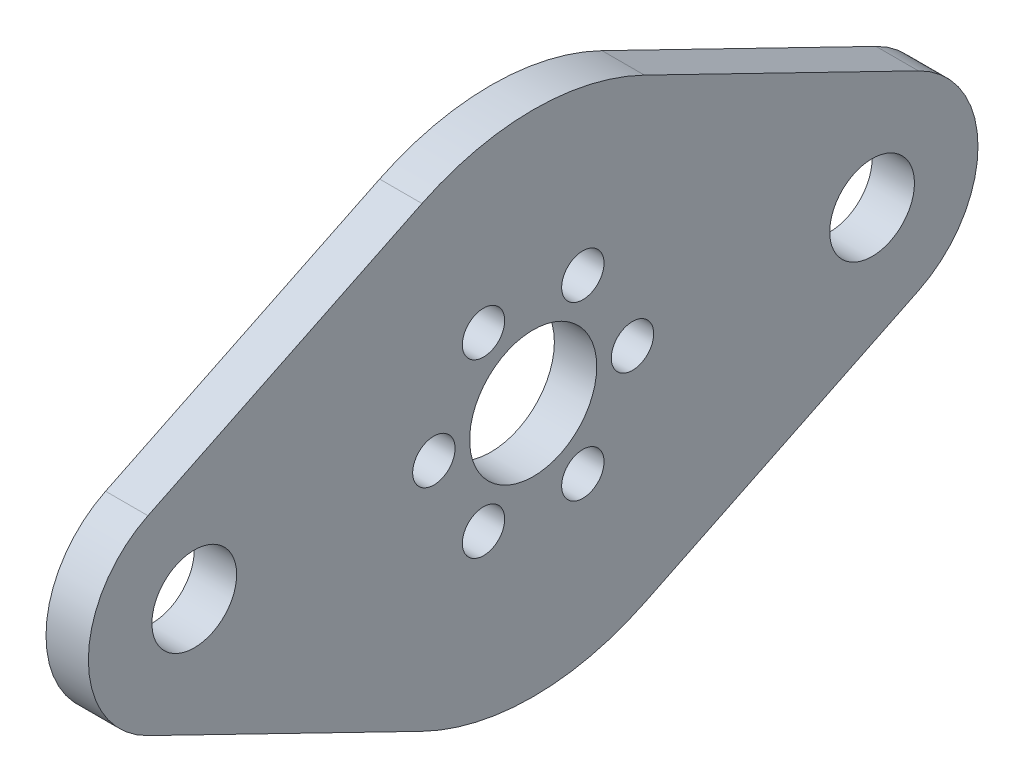
ISO-10303-21;
HEADER;
FILE_DESCRIPTION(('STEP AP214'),'2;1');
FILE_NAME('part.step','',(''),(''),'','','');
FILE_SCHEMA(('AUTOMOTIVE_DESIGN { 1 0 10303 214 1 1 1 1 }'));
ENDSEC;
DATA;
#1=APPLICATION_CONTEXT('core data for automotive mechanical design processes');
#2=APPLICATION_PROTOCOL_DEFINITION('international standard','automotive_design',2000,#1);
#3=PRODUCT_CONTEXT('',#1,'mechanical');
#4=PRODUCT('Part','Part','',(#3));
#5=PRODUCT_RELATED_PRODUCT_CATEGORY('part','',(#4));
#6=PRODUCT_DEFINITION_FORMATION('','',#4);
#7=PRODUCT_DEFINITION_CONTEXT('part definition',#1,'design');
#8=PRODUCT_DEFINITION('design','',#6,#7);
#9=PRODUCT_DEFINITION_SHAPE('','',#8);
#10=(LENGTH_UNIT() NAMED_UNIT(*) SI_UNIT(.MILLI.,.METRE.));
#11=(NAMED_UNIT(*) PLANE_ANGLE_UNIT() SI_UNIT($,.RADIAN.));
#12=(NAMED_UNIT(*) SI_UNIT($,.STERADIAN.) SOLID_ANGLE_UNIT());
#13=UNCERTAINTY_MEASURE_WITH_UNIT(LENGTH_MEASURE(1.E-05),#10,'distance_accuracy_value','');
#14=(GEOMETRIC_REPRESENTATION_CONTEXT(3) GLOBAL_UNCERTAINTY_ASSIGNED_CONTEXT((#13)) GLOBAL_UNIT_ASSIGNED_CONTEXT((#10,
#11,#12)) REPRESENTATION_CONTEXT('',''));
#15=CARTESIAN_POINT('',(0.,0.,0.));
#16=DIRECTION('',(0.,0.,1.));
#17=DIRECTION('',(1.,0.,0.));
#18=AXIS2_PLACEMENT_3D('',#15,#16,#17);
#19=CARTESIAN_POINT('',(3.175,0.,25.4));
#20=DIRECTION('',(1.,0.,0.));
#21=DIRECTION('',(0.,0.,-1.));
#22=AXIS2_PLACEMENT_3D('',#19,#20,#21);
#23=PLANE('',#22);
#24=CARTESIAN_POINT('',(3.175,0.,-7.4422));
#25=DIRECTION('',(1.,0.,0.));
#26=DIRECTION('',(0.,0.,-1.));
#27=AXIS2_PLACEMENT_3D('',#24,#25,#26);
#28=CIRCLE('',#27,1.5875);
#29=CARTESIAN_POINT('',(3.175,0.,-9.0297));
#30=VERTEX_POINT('',#29);
#31=EDGE_CURVE('E217',#30,#30,#28,.T.);
#32=ORIENTED_EDGE('',*,*,#31,.F.);
#33=EDGE_LOOP('',(#32));
#34=FACE_BOUND('',#33,.T.);
#35=CARTESIAN_POINT('',(3.175,6.44513426004454,3.72110000000002));
#36=DIRECTION('',(1.,0.,0.));
#37=DIRECTION('',(0.,0.,-1.));
#38=AXIS2_PLACEMENT_3D('',#35,#36,#37);
#39=CIRCLE('',#38,1.5875);
#40=CARTESIAN_POINT('',(3.175,6.44513426004454,2.13360000000002));
#41=VERTEX_POINT('',#40);
#42=EDGE_CURVE('E205',#41,#41,#39,.T.);
#43=ORIENTED_EDGE('',*,*,#42,.F.);
#44=EDGE_LOOP('',(#43));
#45=FACE_BOUND('',#44,.T.);
#46=CARTESIAN_POINT('',(3.175,-6.44513426004456,3.72109999999998));
#47=DIRECTION('',(1.,0.,0.));
#48=DIRECTION('',(0.,0.,-1.));
#49=AXIS2_PLACEMENT_3D('',#46,#47,#48);
#50=CIRCLE('',#49,1.5875);
#51=CARTESIAN_POINT('',(3.175,-6.44513426004456,2.13359999999998));
#52=VERTEX_POINT('',#51);
#53=EDGE_CURVE('E193',#52,#52,#50,.T.);
#54=ORIENTED_EDGE('',*,*,#53,.F.);
#55=EDGE_LOOP('',(#54));
#56=FACE_BOUND('',#55,.T.);
#57=CARTESIAN_POINT('',(3.175,0.,25.4));
#58=DIRECTION('',(1.,0.,0.));
#59=DIRECTION('',(0.,0.,-1.));
#60=AXIS2_PLACEMENT_3D('',#57,#58,#59);
#61=CIRCLE('',#60,3.175);
#62=CARTESIAN_POINT('',(3.175,0.,22.225));
#63=VERTEX_POINT('',#62);
#64=EDGE_CURVE('E181',#63,#63,#61,.T.);
#65=ORIENTED_EDGE('',*,*,#64,.F.);
#66=EDGE_LOOP('',(#65));
#67=FACE_BOUND('',#66,.T.);
#68=CARTESIAN_POINT('',(3.175,0.,25.4));
#69=DIRECTION('',(1.,0.,0.));
#70=DIRECTION('',(0.,0.,-1.));
#71=AXIS2_PLACEMENT_3D('',#68,#69,#70);
#72=CIRCLE('',#71,7.9375);
#73=CARTESIAN_POINT('',(3.175,7.13754613430525,28.87265625));
#74=VERTEX_POINT('',#73);
#75=CARTESIAN_POINT('',(3.175,-7.13754613430526,28.87265625));
#76=VERTEX_POINT('',#75);
#77=EDGE_CURVE('E144',#74,#76,#72,.T.);
#78=ORIENTED_EDGE('',*,*,#77,.T.);
#79=DIRECTION('',(0.,-0.4375,-0.899218410621135));
#80=VECTOR('',#79,1.);
#81=CARTESIAN_POINT('',(3.175,-17.1301107223326,8.334375));
#82=LINE('',#81,#80);
#83=CARTESIAN_POINT('',(3.175,-17.1301107223326,8.33437499999999));
#84=VERTEX_POINT('',#83);
#85=EDGE_CURVE('E92',#76,#84,#82,.T.);
#86=ORIENTED_EDGE('',*,*,#85,.T.);
#87=CARTESIAN_POINT('',(3.175,0.,0.));
#88=DIRECTION('',(1.,0.,0.));
#89=DIRECTION('',(0.,0.,1.));
#90=AXIS2_PLACEMENT_3D('',#87,#88,#89);
#91=CIRCLE('',#90,19.05);
#92=CARTESIAN_POINT('',(3.175,-17.1301107223326,-8.334375));
#93=VERTEX_POINT('',#92);
#94=EDGE_CURVE('E159',#84,#93,#91,.T.);
#95=ORIENTED_EDGE('',*,*,#94,.T.);
#96=DIRECTION('',(0.,0.437500000000001,-0.899218410621135));
#97=VECTOR('',#96,1.);
#98=CARTESIAN_POINT('',(3.175,-7.13754613430525,-28.87265625));
#99=LINE('',#98,#97);
#100=CARTESIAN_POINT('',(3.175,-7.13754613430525,-28.87265625));
#101=VERTEX_POINT('',#100);
#102=EDGE_CURVE('E172',#93,#101,#99,.T.);
#103=ORIENTED_EDGE('',*,*,#102,.T.);
#104=CARTESIAN_POINT('',(3.175,0.,-25.4));
#105=DIRECTION('',(1.,0.,0.));
#106=DIRECTION('',(0.,0.,1.));
#107=AXIS2_PLACEMENT_3D('',#104,#105,#106);
#108=CIRCLE('',#107,7.9375);
#109=CARTESIAN_POINT('',(3.175,7.13754613430527,-28.87265625));
#110=VERTEX_POINT('',#109);
#111=EDGE_CURVE('E111',#101,#110,#108,.T.);
#112=ORIENTED_EDGE('',*,*,#111,.T.);
#113=DIRECTION('',(0.,0.437500000000001,0.899218410621134));
#114=VECTOR('',#113,1.);
#115=CARTESIAN_POINT('',(3.175,17.1301107223326,-8.33437500000003));
#116=LINE('',#115,#114);
#117=CARTESIAN_POINT('',(3.175,17.1301107223326,-8.33437500000002));
#118=VERTEX_POINT('',#117);
#119=EDGE_CURVE('E105',#110,#118,#116,.T.);
#120=ORIENTED_EDGE('',*,*,#119,.T.);
#121=CARTESIAN_POINT('',(3.175,0.,0.));
#122=DIRECTION('',(1.,0.,0.));
#123=DIRECTION('',(0.,0.,1.));
#124=AXIS2_PLACEMENT_3D('',#121,#122,#123);
#125=CIRCLE('',#124,19.05);
#126=CARTESIAN_POINT('',(3.175,17.1301107223326,8.334375));
#127=VERTEX_POINT('',#126);
#128=EDGE_CURVE('E109',#118,#127,#125,.T.);
#129=ORIENTED_EDGE('',*,*,#128,.T.);
#130=DIRECTION('',(0.,-0.4375,0.899218410621135));
#131=VECTOR('',#130,1.);
#132=CARTESIAN_POINT('',(3.175,7.13754613430525,28.87265625));
#133=LINE('',#132,#131);
#134=EDGE_CURVE('E49',#127,#74,#133,.T.);
#135=ORIENTED_EDGE('',*,*,#134,.T.);
#136=EDGE_LOOP('',(#78,#86,#95,#103,#112,#120,#129,#135));
#137=FACE_BOUND('',#136,.T.);
#138=CARTESIAN_POINT('',(3.175,0.,0.));
#139=DIRECTION('',(1.,0.,0.));
#140=DIRECTION('',(0.,0.,-1.));
#141=AXIS2_PLACEMENT_3D('',#138,#139,#140);
#142=CIRCLE('',#141,4.7625);
#143=CARTESIAN_POINT('',(3.175,0.,-4.7625));
#144=VERTEX_POINT('',#143);
#145=EDGE_CURVE('E133',#144,#144,#142,.T.);
#146=ORIENTED_EDGE('',*,*,#145,.F.);
#147=EDGE_LOOP('',(#146));
#148=FACE_BOUND('',#147,.T.);
#149=CARTESIAN_POINT('',(3.175,0.,-25.4));
#150=DIRECTION('',(1.,0.,0.));
#151=DIRECTION('',(0.,0.,-1.));
#152=AXIS2_PLACEMENT_3D('',#149,#150,#151);
#153=CIRCLE('',#152,3.175);
#154=CARTESIAN_POINT('',(3.175,0.,-28.575));
#155=VERTEX_POINT('',#154);
#156=EDGE_CURVE('E187',#155,#155,#153,.T.);
#157=ORIENTED_EDGE('',*,*,#156,.F.);
#158=EDGE_LOOP('',(#157));
#159=FACE_BOUND('',#158,.T.);
#160=CARTESIAN_POINT('',(3.175,6.44513426004456,-3.72109999999998));
#161=DIRECTION('',(1.,0.,0.));
#162=DIRECTION('',(0.,0.,-1.));
#163=AXIS2_PLACEMENT_3D('',#160,#161,#162);
#164=CIRCLE('',#163,1.5875);
#165=CARTESIAN_POINT('',(3.175,6.44513426004456,-5.30859999999998));
#166=VERTEX_POINT('',#165);
#167=EDGE_CURVE('E199',#166,#166,#164,.T.);
#168=ORIENTED_EDGE('',*,*,#167,.F.);
#169=EDGE_LOOP('',(#168));
#170=FACE_BOUND('',#169,.T.);
#171=CARTESIAN_POINT('',(3.175,-6.44513426004454,-3.72110000000002));
#172=DIRECTION('',(1.,0.,0.));
#173=DIRECTION('',(0.,0.,-1.));
#174=AXIS2_PLACEMENT_3D('',#171,#172,#173);
#175=CIRCLE('',#174,1.5875);
#176=CARTESIAN_POINT('',(3.175,-6.44513426004454,-5.30860000000002));
#177=VERTEX_POINT('',#176);
#178=EDGE_CURVE('E211',#177,#177,#175,.T.);
#179=ORIENTED_EDGE('',*,*,#178,.F.);
#180=EDGE_LOOP('',(#179));
#181=FACE_BOUND('',#180,.T.);
#182=CARTESIAN_POINT('',(3.175,0.,7.4422));
#183=DIRECTION('',(1.,0.,0.));
#184=DIRECTION('',(0.,0.,-1.));
#185=AXIS2_PLACEMENT_3D('',#182,#183,#184);
#186=CIRCLE('',#185,1.5875);
#187=CARTESIAN_POINT('',(3.175,0.,5.8547));
#188=VERTEX_POINT('',#187);
#189=EDGE_CURVE('E223',#188,#188,#186,.T.);
#190=ORIENTED_EDGE('',*,*,#189,.F.);
#191=EDGE_LOOP('',(#190));
#192=FACE_BOUND('',#191,.T.);
#193=ADVANCED_FACE('F32',(#34,#45,#56,#67,#137,#148,#159,#170,#181,#192),#23,.T.);
#194=CARTESIAN_POINT('',(0.,0.,25.4));
#195=DIRECTION('',(1.,0.,0.));
#196=DIRECTION('',(0.,0.,-1.));
#197=AXIS2_PLACEMENT_3D('',#194,#195,#196);
#198=PLANE('',#197);
#199=CARTESIAN_POINT('',(0.,0.,25.4));
#200=DIRECTION('',(1.,0.,0.));
#201=DIRECTION('',(0.,0.,-1.));
#202=AXIS2_PLACEMENT_3D('',#199,#200,#201);
#203=CIRCLE('',#202,7.9375);
#204=CARTESIAN_POINT('',(0.,7.13754613430525,28.87265625));
#205=VERTEX_POINT('',#204);
#206=CARTESIAN_POINT('',(0.,-7.13754613430526,28.87265625));
#207=VERTEX_POINT('',#206);
#208=EDGE_CURVE('E129',#205,#207,#203,.T.);
#209=ORIENTED_EDGE('',*,*,#208,.F.);
#210=DIRECTION('',(0.,-0.4375,0.899218410621135));
#211=VECTOR('',#210,1.);
#212=CARTESIAN_POINT('',(0.,7.13754613430525,28.87265625));
#213=LINE('',#212,#211);
#214=CARTESIAN_POINT('',(0.,17.1301107223326,8.334375));
#215=VERTEX_POINT('',#214);
#216=EDGE_CURVE('E84',#215,#205,#213,.T.);
#217=ORIENTED_EDGE('',*,*,#216,.F.);
#218=CARTESIAN_POINT('',(0.,0.,0.));
#219=DIRECTION('',(1.,0.,0.));
#220=DIRECTION('',(0.,0.,1.));
#221=AXIS2_PLACEMENT_3D('',#218,#219,#220);
#222=CIRCLE('',#221,19.05);
#223=CARTESIAN_POINT('',(0.,17.1301107223326,-8.33437500000002));
#224=VERTEX_POINT('',#223);
#225=EDGE_CURVE('E78',#224,#215,#222,.T.);
#226=ORIENTED_EDGE('',*,*,#225,.F.);
#227=DIRECTION('',(0.,0.437500000000001,0.899218410621134));
#228=VECTOR('',#227,1.);
#229=CARTESIAN_POINT('',(0.,17.1301107223326,-8.33437500000003));
#230=LINE('',#229,#228);
#231=CARTESIAN_POINT('',(0.,7.13754613430527,-28.87265625));
#232=VERTEX_POINT('',#231);
#233=EDGE_CURVE('E119',#232,#224,#230,.T.);
#234=ORIENTED_EDGE('',*,*,#233,.F.);
#235=CARTESIAN_POINT('',(0.,0.,-25.4));
#236=DIRECTION('',(1.,0.,0.));
#237=DIRECTION('',(0.,0.,1.));
#238=AXIS2_PLACEMENT_3D('',#235,#236,#237);
#239=CIRCLE('',#238,7.9375);
#240=CARTESIAN_POINT('',(0.,-7.13754613430525,-28.87265625));
#241=VERTEX_POINT('',#240);
#242=EDGE_CURVE('E139',#241,#232,#239,.T.);
#243=ORIENTED_EDGE('',*,*,#242,.F.);
#244=DIRECTION('',(0.,0.437500000000001,-0.899218410621135));
#245=VECTOR('',#244,1.);
#246=CARTESIAN_POINT('',(0.,-7.13754613430525,-28.87265625));
#247=LINE('',#246,#245);
#248=CARTESIAN_POINT('',(0.,-17.1301107223326,-8.334375));
#249=VERTEX_POINT('',#248);
#250=EDGE_CURVE('E137',#249,#241,#247,.T.);
#251=ORIENTED_EDGE('',*,*,#250,.F.);
#252=CARTESIAN_POINT('',(0.,0.,0.));
#253=DIRECTION('',(1.,0.,0.));
#254=DIRECTION('',(0.,0.,1.));
#255=AXIS2_PLACEMENT_3D('',#252,#253,#254);
#256=CIRCLE('',#255,19.05);
#257=CARTESIAN_POINT('',(0.,-17.1301107223326,8.33437499999999));
#258=VERTEX_POINT('',#257);
#259=EDGE_CURVE('E135',#258,#249,#256,.T.);
#260=ORIENTED_EDGE('',*,*,#259,.F.);
#261=DIRECTION('',(0.,-0.4375,-0.899218410621135));
#262=VECTOR('',#261,1.);
#263=CARTESIAN_POINT('',(0.,-17.1301107223326,8.334375));
#264=LINE('',#263,#262);
#265=EDGE_CURVE('E132',#207,#258,#264,.T.);
#266=ORIENTED_EDGE('',*,*,#265,.F.);
#267=EDGE_LOOP('',(#209,#217,#226,#234,#243,#251,#260,#266));
#268=FACE_BOUND('',#267,.T.);
#269=CARTESIAN_POINT('',(0.,0.,0.));
#270=DIRECTION('',(1.,0.,0.));
#271=DIRECTION('',(0.,0.,-1.));
#272=AXIS2_PLACEMENT_3D('',#269,#270,#271);
#273=CIRCLE('',#272,4.7625);
#274=CARTESIAN_POINT('',(0.,0.,-4.7625));
#275=VERTEX_POINT('',#274);
#276=EDGE_CURVE('E178',#275,#275,#273,.T.);
#277=ORIENTED_EDGE('',*,*,#276,.T.);
#278=EDGE_LOOP('',(#277));
#279=FACE_BOUND('',#278,.T.);
#280=CARTESIAN_POINT('',(0.,0.,25.4));
#281=DIRECTION('',(1.,0.,0.));
#282=DIRECTION('',(0.,0.,-1.));
#283=AXIS2_PLACEMENT_3D('',#280,#281,#282);
#284=CIRCLE('',#283,3.175);
#285=CARTESIAN_POINT('',(0.,0.,22.225));
#286=VERTEX_POINT('',#285);
#287=EDGE_CURVE('E184',#286,#286,#284,.T.);
#288=ORIENTED_EDGE('',*,*,#287,.T.);
#289=EDGE_LOOP('',(#288));
#290=FACE_BOUND('',#289,.T.);
#291=CARTESIAN_POINT('',(0.,0.,-25.4));
#292=DIRECTION('',(1.,0.,0.));
#293=DIRECTION('',(0.,0.,-1.));
#294=AXIS2_PLACEMENT_3D('',#291,#292,#293);
#295=CIRCLE('',#294,3.175);
#296=CARTESIAN_POINT('',(0.,0.,-28.575));
#297=VERTEX_POINT('',#296);
#298=EDGE_CURVE('E190',#297,#297,#295,.T.);
#299=ORIENTED_EDGE('',*,*,#298,.T.);
#300=EDGE_LOOP('',(#299));
#301=FACE_BOUND('',#300,.T.);
#302=CARTESIAN_POINT('',(0.,-6.44513426004456,3.72109999999998));
#303=DIRECTION('',(1.,0.,0.));
#304=DIRECTION('',(0.,0.,-1.));
#305=AXIS2_PLACEMENT_3D('',#302,#303,#304);
#306=CIRCLE('',#305,1.5875);
#307=CARTESIAN_POINT('',(0.,-6.44513426004456,2.13359999999998));
#308=VERTEX_POINT('',#307);
#309=EDGE_CURVE('E196',#308,#308,#306,.T.);
#310=ORIENTED_EDGE('',*,*,#309,.T.);
#311=EDGE_LOOP('',(#310));
#312=FACE_BOUND('',#311,.T.);
#313=CARTESIAN_POINT('',(0.,6.44513426004456,-3.72109999999998));
#314=DIRECTION('',(1.,0.,0.));
#315=DIRECTION('',(0.,0.,-1.));
#316=AXIS2_PLACEMENT_3D('',#313,#314,#315);
#317=CIRCLE('',#316,1.5875);
#318=CARTESIAN_POINT('',(0.,6.44513426004456,-5.30859999999998));
#319=VERTEX_POINT('',#318);
#320=EDGE_CURVE('E202',#319,#319,#317,.T.);
#321=ORIENTED_EDGE('',*,*,#320,.T.);
#322=EDGE_LOOP('',(#321));
#323=FACE_BOUND('',#322,.T.);
#324=CARTESIAN_POINT('',(0.,6.44513426004454,3.72110000000002));
#325=DIRECTION('',(1.,0.,0.));
#326=DIRECTION('',(0.,0.,-1.));
#327=AXIS2_PLACEMENT_3D('',#324,#325,#326);
#328=CIRCLE('',#327,1.5875);
#329=CARTESIAN_POINT('',(0.,6.44513426004454,2.13360000000002));
#330=VERTEX_POINT('',#329);
#331=EDGE_CURVE('E208',#330,#330,#328,.T.);
#332=ORIENTED_EDGE('',*,*,#331,.T.);
#333=EDGE_LOOP('',(#332));
#334=FACE_BOUND('',#333,.T.);
#335=CARTESIAN_POINT('',(0.,-6.44513426004454,-3.72110000000002));
#336=DIRECTION('',(1.,0.,0.));
#337=DIRECTION('',(0.,0.,-1.));
#338=AXIS2_PLACEMENT_3D('',#335,#336,#337);
#339=CIRCLE('',#338,1.5875);
#340=CARTESIAN_POINT('',(0.,-6.44513426004454,-5.30860000000002));
#341=VERTEX_POINT('',#340);
#342=EDGE_CURVE('E214',#341,#341,#339,.T.);
#343=ORIENTED_EDGE('',*,*,#342,.T.);
#344=EDGE_LOOP('',(#343));
#345=FACE_BOUND('',#344,.T.);
#346=CARTESIAN_POINT('',(0.,0.,-7.4422));
#347=DIRECTION('',(1.,0.,0.));
#348=DIRECTION('',(0.,0.,-1.));
#349=AXIS2_PLACEMENT_3D('',#346,#347,#348);
#350=CIRCLE('',#349,1.5875);
#351=CARTESIAN_POINT('',(0.,0.,-9.0297));
#352=VERTEX_POINT('',#351);
#353=EDGE_CURVE('E220',#352,#352,#350,.T.);
#354=ORIENTED_EDGE('',*,*,#353,.T.);
#355=EDGE_LOOP('',(#354));
#356=FACE_BOUND('',#355,.T.);
#357=CARTESIAN_POINT('',(0.,0.,7.4422));
#358=DIRECTION('',(1.,0.,0.));
#359=DIRECTION('',(0.,0.,-1.));
#360=AXIS2_PLACEMENT_3D('',#357,#358,#359);
#361=CIRCLE('',#360,1.5875);
#362=CARTESIAN_POINT('',(0.,0.,5.8547));
#363=VERTEX_POINT('',#362);
#364=EDGE_CURVE('E226',#363,#363,#361,.T.);
#365=ORIENTED_EDGE('',*,*,#364,.T.);
#366=EDGE_LOOP('',(#365));
#367=FACE_BOUND('',#366,.T.);
#368=ADVANCED_FACE('F163',(#268,#279,#290,#301,#312,#323,#334,#345,#356,#367),#198,.F.);
#369=CARTESIAN_POINT('',(3.175,0.,25.4));
#370=DIRECTION('',(-1.,0.,0.));
#371=DIRECTION('',(0.,0.,1.));
#372=AXIS2_PLACEMENT_3D('',#369,#370,#371);
#373=CYLINDRICAL_SURFACE('',#372,7.9375);
#374=ORIENTED_EDGE('',*,*,#208,.T.);
#375=DIRECTION('',(-1.,0.,0.));
#376=VECTOR('',#375,1.);
#377=CARTESIAN_POINT('',(3.175,-7.13754613430526,28.87265625));
#378=LINE('',#377,#376);
#379=EDGE_CURVE('E11',#76,#207,#378,.T.);
#380=ORIENTED_EDGE('',*,*,#379,.F.);
#381=ORIENTED_EDGE('',*,*,#77,.F.);
#382=DIRECTION('',(-1.,0.,0.));
#383=VECTOR('',#382,1.);
#384=CARTESIAN_POINT('',(3.175,7.13754613430525,28.87265625));
#385=LINE('',#384,#383);
#386=EDGE_CURVE('E125',#74,#205,#385,.T.);
#387=ORIENTED_EDGE('',*,*,#386,.T.);
#388=EDGE_LOOP('',(#374,#380,#381,#387));
#389=FACE_BOUND('',#388,.T.);
#390=ADVANCED_FACE('F34',(#389),#373,.T.);
#391=CARTESIAN_POINT('',(3.175,-17.1301107223326,8.334375));
#392=DIRECTION('',(0.,0.899218410621135,-0.4375));
#393=DIRECTION('',(0.,0.4375,0.899218410621135));
#394=AXIS2_PLACEMENT_3D('',#391,#392,#393);
#395=PLANE('',#394);
#396=ORIENTED_EDGE('',*,*,#265,.T.);
#397=DIRECTION('',(-1.,0.,0.));
#398=VECTOR('',#397,1.);
#399=CARTESIAN_POINT('',(3.175,-17.1301107223326,8.33437499999999));
#400=LINE('',#399,#398);
#401=EDGE_CURVE('E41',#84,#258,#400,.T.);
#402=ORIENTED_EDGE('',*,*,#401,.F.);
#403=ORIENTED_EDGE('',*,*,#85,.F.);
#404=ORIENTED_EDGE('',*,*,#379,.T.);
#405=EDGE_LOOP('',(#396,#402,#403,#404));
#406=FACE_BOUND('',#405,.T.);
#407=ADVANCED_FACE('F260',(#406),#395,.F.);
#408=CARTESIAN_POINT('',(3.175,0.,0.));
#409=DIRECTION('',(-1.,0.,0.));
#410=DIRECTION('',(0.,0.,1.));
#411=AXIS2_PLACEMENT_3D('',#408,#409,#410);
#412=CYLINDRICAL_SURFACE('',#411,19.05);
#413=ORIENTED_EDGE('',*,*,#259,.T.);
#414=DIRECTION('',(-1.,0.,0.));
#415=VECTOR('',#414,1.);
#416=CARTESIAN_POINT('',(3.175,-17.1301107223326,-8.334375));
#417=LINE('',#416,#415);
#418=EDGE_CURVE('E151',#93,#249,#417,.T.);
#419=ORIENTED_EDGE('',*,*,#418,.F.);
#420=ORIENTED_EDGE('',*,*,#94,.F.);
#421=ORIENTED_EDGE('',*,*,#401,.T.);
#422=EDGE_LOOP('',(#413,#419,#420,#421));
#423=FACE_BOUND('',#422,.T.);
#424=ADVANCED_FACE('F157',(#423),#412,.T.);
#425=CARTESIAN_POINT('',(3.175,-7.13754613430525,-28.87265625));
#426=DIRECTION('',(0.,0.899218410621135,0.4375));
#427=DIRECTION('',(0.,-0.437500000000001,0.899218410621135));
#428=AXIS2_PLACEMENT_3D('',#425,#426,#427);
#429=PLANE('',#428);
#430=ORIENTED_EDGE('',*,*,#250,.T.);
#431=DIRECTION('',(-1.,0.,0.));
#432=VECTOR('',#431,1.);
#433=CARTESIAN_POINT('',(3.175,-7.13754613430525,-28.87265625));
#434=LINE('',#433,#432);
#435=EDGE_CURVE('E148',#101,#241,#434,.T.);
#436=ORIENTED_EDGE('',*,*,#435,.F.);
#437=ORIENTED_EDGE('',*,*,#102,.F.);
#438=ORIENTED_EDGE('',*,*,#418,.T.);
#439=EDGE_LOOP('',(#430,#436,#437,#438));
#440=FACE_BOUND('',#439,.T.);
#441=ADVANCED_FACE('F168',(#440),#429,.F.);
#442=CARTESIAN_POINT('',(3.175,0.,-25.4));
#443=DIRECTION('',(-1.,0.,0.));
#444=DIRECTION('',(0.,0.,1.));
#445=AXIS2_PLACEMENT_3D('',#442,#443,#444);
#446=CYLINDRICAL_SURFACE('',#445,7.9375);
#447=ORIENTED_EDGE('',*,*,#242,.T.);
#448=DIRECTION('',(-1.,0.,0.));
#449=VECTOR('',#448,1.);
#450=CARTESIAN_POINT('',(3.175,7.13754613430527,-28.87265625));
#451=LINE('',#450,#449);
#452=EDGE_CURVE('E120',#110,#232,#451,.T.);
#453=ORIENTED_EDGE('',*,*,#452,.F.);
#454=ORIENTED_EDGE('',*,*,#111,.F.);
#455=ORIENTED_EDGE('',*,*,#435,.T.);
#456=EDGE_LOOP('',(#447,#453,#454,#455));
#457=FACE_BOUND('',#456,.T.);
#458=ADVANCED_FACE('F171',(#457),#446,.T.);
#459=CARTESIAN_POINT('',(3.175,17.1301107223326,-8.33437500000003));
#460=DIRECTION('',(0.,-0.899218410621134,0.437500000000001));
#461=DIRECTION('',(0.,-0.437500000000001,-0.899218410621134));
#462=AXIS2_PLACEMENT_3D('',#459,#460,#461);
#463=PLANE('',#462);
#464=ORIENTED_EDGE('',*,*,#233,.T.);
#465=DIRECTION('',(-1.,0.,0.));
#466=VECTOR('',#465,1.);
#467=CARTESIAN_POINT('',(3.175,17.1301107223326,-8.33437500000002));
#468=LINE('',#467,#466);
#469=EDGE_CURVE('E116',#118,#224,#468,.T.);
#470=ORIENTED_EDGE('',*,*,#469,.F.);
#471=ORIENTED_EDGE('',*,*,#119,.F.);
#472=ORIENTED_EDGE('',*,*,#452,.T.);
#473=EDGE_LOOP('',(#464,#470,#471,#472));
#474=FACE_BOUND('',#473,.T.);
#475=ADVANCED_FACE('F117',(#474),#463,.F.);
#476=CARTESIAN_POINT('',(3.175,0.,0.));
#477=DIRECTION('',(-1.,0.,0.));
#478=DIRECTION('',(0.,0.,1.));
#479=AXIS2_PLACEMENT_3D('',#476,#477,#478);
#480=CYLINDRICAL_SURFACE('',#479,19.05);
#481=ORIENTED_EDGE('',*,*,#225,.T.);
#482=DIRECTION('',(-1.,0.,0.));
#483=VECTOR('',#482,1.);
#484=CARTESIAN_POINT('',(3.175,17.1301107223326,8.334375));
#485=LINE('',#484,#483);
#486=EDGE_CURVE('E121',#127,#215,#485,.T.);
#487=ORIENTED_EDGE('',*,*,#486,.F.);
#488=ORIENTED_EDGE('',*,*,#128,.F.);
#489=ORIENTED_EDGE('',*,*,#469,.T.);
#490=EDGE_LOOP('',(#481,#487,#488,#489));
#491=FACE_BOUND('',#490,.T.);
#492=ADVANCED_FACE('F123',(#491),#480,.T.);
#493=CARTESIAN_POINT('',(3.175,7.13754613430525,28.87265625));
#494=DIRECTION('',(0.,-0.899218410621135,-0.4375));
#495=DIRECTION('',(0.,0.4375,-0.899218410621135));
#496=AXIS2_PLACEMENT_3D('',#493,#494,#495);
#497=PLANE('',#496);
#498=ORIENTED_EDGE('',*,*,#216,.T.);
#499=ORIENTED_EDGE('',*,*,#386,.F.);
#500=ORIENTED_EDGE('',*,*,#134,.F.);
#501=ORIENTED_EDGE('',*,*,#486,.T.);
#502=EDGE_LOOP('',(#498,#499,#500,#501));
#503=FACE_BOUND('',#502,.T.);
#504=ADVANCED_FACE('F248',(#503),#497,.F.);
#505=CARTESIAN_POINT('',(3.175,0.,0.));
#506=DIRECTION('',(-1.,0.,0.));
#507=DIRECTION('',(0.,0.,1.));
#508=AXIS2_PLACEMENT_3D('',#505,#506,#507);
#509=CYLINDRICAL_SURFACE('',#508,4.7625);
#510=ORIENTED_EDGE('',*,*,#145,.T.);
#511=EDGE_LOOP('',(#510));
#512=FACE_BOUND('',#511,.T.);
#513=ORIENTED_EDGE('',*,*,#276,.F.);
#514=EDGE_LOOP('',(#513));
#515=FACE_BOUND('',#514,.T.);
#516=ADVANCED_FACE('F245',(#512,#515),#509,.F.);
#517=CARTESIAN_POINT('',(3.175,0.,25.4));
#518=DIRECTION('',(-1.,0.,0.));
#519=DIRECTION('',(0.,0.,1.));
#520=AXIS2_PLACEMENT_3D('',#517,#518,#519);
#521=CYLINDRICAL_SURFACE('',#520,3.175);
#522=ORIENTED_EDGE('',*,*,#64,.T.);
#523=EDGE_LOOP('',(#522));
#524=FACE_BOUND('',#523,.T.);
#525=ORIENTED_EDGE('',*,*,#287,.F.);
#526=EDGE_LOOP('',(#525));
#527=FACE_BOUND('',#526,.T.);
#528=ADVANCED_FACE('F324',(#524,#527),#521,.F.);
#529=CARTESIAN_POINT('',(3.175,0.,-25.4));
#530=DIRECTION('',(-1.,0.,0.));
#531=DIRECTION('',(0.,0.,1.));
#532=AXIS2_PLACEMENT_3D('',#529,#530,#531);
#533=CYLINDRICAL_SURFACE('',#532,3.175);
#534=ORIENTED_EDGE('',*,*,#156,.T.);
#535=EDGE_LOOP('',(#534));
#536=FACE_BOUND('',#535,.T.);
#537=ORIENTED_EDGE('',*,*,#298,.F.);
#538=EDGE_LOOP('',(#537));
#539=FACE_BOUND('',#538,.T.);
#540=ADVANCED_FACE('F332',(#536,#539),#533,.F.);
#541=CARTESIAN_POINT('',(3.175,-6.44513426004456,3.72109999999998));
#542=DIRECTION('',(-1.,0.,0.));
#543=DIRECTION('',(0.,0.,1.));
#544=AXIS2_PLACEMENT_3D('',#541,#542,#543);
#545=CYLINDRICAL_SURFACE('',#544,1.5875);
#546=ORIENTED_EDGE('',*,*,#53,.T.);
#547=EDGE_LOOP('',(#546));
#548=FACE_BOUND('',#547,.T.);
#549=ORIENTED_EDGE('',*,*,#309,.F.);
#550=EDGE_LOOP('',(#549));
#551=FACE_BOUND('',#550,.T.);
#552=ADVANCED_FACE('F340',(#548,#551),#545,.F.);
#553=CARTESIAN_POINT('',(3.175,6.44513426004456,-3.72109999999998));
#554=DIRECTION('',(-1.,0.,0.));
#555=DIRECTION('',(0.,0.,1.));
#556=AXIS2_PLACEMENT_3D('',#553,#554,#555);
#557=CYLINDRICAL_SURFACE('',#556,1.5875);
#558=ORIENTED_EDGE('',*,*,#167,.T.);
#559=EDGE_LOOP('',(#558));
#560=FACE_BOUND('',#559,.T.);
#561=ORIENTED_EDGE('',*,*,#320,.F.);
#562=EDGE_LOOP('',(#561));
#563=FACE_BOUND('',#562,.T.);
#564=ADVANCED_FACE('F349',(#560,#563),#557,.F.);
#565=CARTESIAN_POINT('',(3.175,6.44513426004454,3.72110000000002));
#566=DIRECTION('',(-1.,0.,0.));
#567=DIRECTION('',(0.,0.,1.));
#568=AXIS2_PLACEMENT_3D('',#565,#566,#567);
#569=CYLINDRICAL_SURFACE('',#568,1.5875);
#570=ORIENTED_EDGE('',*,*,#42,.T.);
#571=EDGE_LOOP('',(#570));
#572=FACE_BOUND('',#571,.T.);
#573=ORIENTED_EDGE('',*,*,#331,.F.);
#574=EDGE_LOOP('',(#573));
#575=FACE_BOUND('',#574,.T.);
#576=ADVANCED_FACE('F358',(#572,#575),#569,.F.);
#577=CARTESIAN_POINT('',(3.175,-6.44513426004454,-3.72110000000002));
#578=DIRECTION('',(-1.,0.,0.));
#579=DIRECTION('',(0.,0.,1.));
#580=AXIS2_PLACEMENT_3D('',#577,#578,#579);
#581=CYLINDRICAL_SURFACE('',#580,1.5875);
#582=ORIENTED_EDGE('',*,*,#178,.T.);
#583=EDGE_LOOP('',(#582));
#584=FACE_BOUND('',#583,.T.);
#585=ORIENTED_EDGE('',*,*,#342,.F.);
#586=EDGE_LOOP('',(#585));
#587=FACE_BOUND('',#586,.T.);
#588=ADVANCED_FACE('F367',(#584,#587),#581,.F.);
#589=CARTESIAN_POINT('',(3.175,0.,-7.4422));
#590=DIRECTION('',(-1.,0.,0.));
#591=DIRECTION('',(0.,0.,1.));
#592=AXIS2_PLACEMENT_3D('',#589,#590,#591);
#593=CYLINDRICAL_SURFACE('',#592,1.5875);
#594=ORIENTED_EDGE('',*,*,#31,.T.);
#595=EDGE_LOOP('',(#594));
#596=FACE_BOUND('',#595,.T.);
#597=ORIENTED_EDGE('',*,*,#353,.F.);
#598=EDGE_LOOP('',(#597));
#599=FACE_BOUND('',#598,.T.);
#600=ADVANCED_FACE('F376',(#596,#599),#593,.F.);
#601=CARTESIAN_POINT('',(3.175,0.,7.4422));
#602=DIRECTION('',(-1.,0.,0.));
#603=DIRECTION('',(0.,0.,1.));
#604=AXIS2_PLACEMENT_3D('',#601,#602,#603);
#605=CYLINDRICAL_SURFACE('',#604,1.5875);
#606=ORIENTED_EDGE('',*,*,#189,.T.);
#607=EDGE_LOOP('',(#606));
#608=FACE_BOUND('',#607,.T.);
#609=ORIENTED_EDGE('',*,*,#364,.F.);
#610=EDGE_LOOP('',(#609));
#611=FACE_BOUND('',#610,.T.);
#612=ADVANCED_FACE('F232',(#608,#611),#605,.F.);
#613=CLOSED_SHELL('',(#193,#368,#390,#407,#424,#441,#458,#475,#492,#504,#516,#528,#540,#552,
#564,#576,#588,#600,#612));
#614=MANIFOLD_SOLID_BREP('B2',#613);
#615=ADVANCED_BREP_SHAPE_REPRESENTATION('',(#18,#614),#14);
#616=SHAPE_DEFINITION_REPRESENTATION(#9,#615);
ENDSEC;
END-ISO-10303-21;
